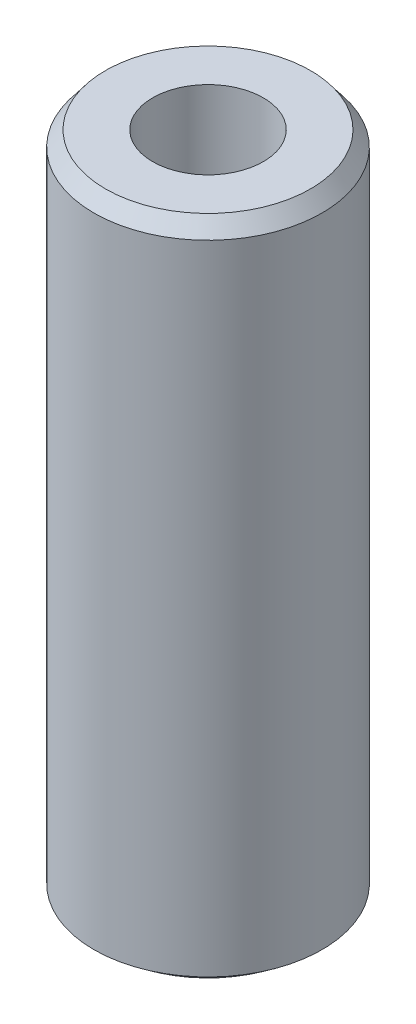
ISO-10303-21;
HEADER;
FILE_DESCRIPTION(('STEP AP214'),'2;1');
FILE_NAME('part.step','',(''),(''),'','','');
FILE_SCHEMA(('AUTOMOTIVE_DESIGN { 1 0 10303 214 1 1 1 1 }'));
ENDSEC;
DATA;
#1=APPLICATION_CONTEXT('core data for automotive mechanical design processes');
#2=APPLICATION_PROTOCOL_DEFINITION('international standard','automotive_design',2000,#1);
#3=PRODUCT_CONTEXT('',#1,'mechanical');
#4=PRODUCT('Part','Part','',(#3));
#5=PRODUCT_RELATED_PRODUCT_CATEGORY('part','',(#4));
#6=PRODUCT_DEFINITION_FORMATION('','',#4);
#7=PRODUCT_DEFINITION_CONTEXT('part definition',#1,'design');
#8=PRODUCT_DEFINITION('design','',#6,#7);
#9=PRODUCT_DEFINITION_SHAPE('','',#8);
#10=(LENGTH_UNIT() NAMED_UNIT(*) SI_UNIT(.MILLI.,.METRE.));
#11=(NAMED_UNIT(*) PLANE_ANGLE_UNIT() SI_UNIT($,.RADIAN.));
#12=(NAMED_UNIT(*) SI_UNIT($,.STERADIAN.) SOLID_ANGLE_UNIT());
#13=UNCERTAINTY_MEASURE_WITH_UNIT(LENGTH_MEASURE(1.E-05),#10,'distance_accuracy_value','');
#14=(GEOMETRIC_REPRESENTATION_CONTEXT(3) GLOBAL_UNCERTAINTY_ASSIGNED_CONTEXT((#13)) GLOBAL_UNIT_ASSIGNED_CONTEXT((#10,
#11,#12)) REPRESENTATION_CONTEXT('',''));
#15=CARTESIAN_POINT('',(0.,0.,0.));
#16=DIRECTION('',(0.,0.,1.));
#17=DIRECTION('',(1.,0.,0.));
#18=AXIS2_PLACEMENT_3D('',#15,#16,#17);
#19=CARTESIAN_POINT('',(0.,58.2442623741684,0.));
#20=DIRECTION('',(0.,-1.,0.));
#21=DIRECTION('',(0.,0.,-1.));
#22=AXIS2_PLACEMENT_3D('',#19,#20,#21);
#23=CYLINDRICAL_SURFACE('',#22,10.);
#24=CARTESIAN_POINT('',(0.,56.9223678370579,0.));
#25=DIRECTION('',(0.,1.,0.));
#26=DIRECTION('',(0.,0.,1.));
#27=AXIS2_PLACEMENT_3D('',#24,#25,#26);
#28=CIRCLE('',#27,10.);
#29=CARTESIAN_POINT('',(0.,56.9223678370579,10.));
#30=VERTEX_POINT('',#29);
#31=EDGE_CURVE('E50',#30,#30,#28,.F.);
#32=ORIENTED_EDGE('',*,*,#31,.T.);
#33=EDGE_LOOP('',(#32));
#34=FACE_BOUND('',#33,.T.);
#35=CARTESIAN_POINT('',(0.,1.01318082991277,0.));
#36=DIRECTION('',(0.,1.,0.));
#37=DIRECTION('',(0.,0.,1.));
#38=AXIS2_PLACEMENT_3D('',#35,#36,#37);
#39=CIRCLE('',#38,10.);
#40=CARTESIAN_POINT('',(0.,1.01318082991277,10.));
#41=VERTEX_POINT('',#40);
#42=EDGE_CURVE('E51',#41,#41,#39,.T.);
#43=ORIENTED_EDGE('',*,*,#42,.T.);
#44=EDGE_LOOP('',(#43));
#45=FACE_BOUND('',#44,.T.);
#46=ADVANCED_FACE('F39',(#34,#45),#23,.T.);
#47=CARTESIAN_POINT('',(0.,58.2442623741684,0.));
#48=DIRECTION('',(0.,1.,0.));
#49=DIRECTION('',(0.,0.,1.));
#50=AXIS2_PLACEMENT_3D('',#47,#48,#49);
#51=PLANE('',#50);
#52=CARTESIAN_POINT('',(0.,58.2442623741684,0.));
#53=DIRECTION('',(0.,1.,0.));
#54=DIRECTION('',(0.,0.,1.));
#55=AXIS2_PLACEMENT_3D('',#52,#53,#54);
#56=CIRCLE('',#55,8.98681917008725);
#57=CARTESIAN_POINT('',(0.,58.2442623741684,8.98681917008725));
#58=VERTEX_POINT('',#57);
#59=EDGE_CURVE('E54',#58,#58,#56,.T.);
#60=ORIENTED_EDGE('',*,*,#59,.T.);
#61=EDGE_LOOP('',(#60));
#62=FACE_BOUND('',#61,.T.);
#63=CARTESIAN_POINT('',(0.,58.2442623741684,0.));
#64=DIRECTION('',(0.,1.,0.));
#65=DIRECTION('',(0.,0.,1.));
#66=AXIS2_PLACEMENT_3D('',#63,#64,#65);
#67=CIRCLE('',#66,4.85031976580231);
#68=CARTESIAN_POINT('',(0.,58.2442623741684,4.85031976580231));
#69=VERTEX_POINT('',#68);
#70=EDGE_CURVE('E58',#69,#69,#67,.T.);
#71=ORIENTED_EDGE('',*,*,#70,.F.);
#72=EDGE_LOOP('',(#71));
#73=FACE_BOUND('',#72,.T.);
#74=ADVANCED_FACE('F69',(#62,#73),#51,.T.);
#75=CARTESIAN_POINT('',(0.,0.,0.));
#76=DIRECTION('',(0.,1.,0.));
#77=DIRECTION('',(0.,0.,1.));
#78=AXIS2_PLACEMENT_3D('',#75,#76,#77);
#79=PLANE('',#78);
#80=CARTESIAN_POINT('',(0.,0.,0.));
#81=DIRECTION('',(0.,1.,0.));
#82=DIRECTION('',(0.,0.,1.));
#83=AXIS2_PLACEMENT_3D('',#80,#81,#82);
#84=CIRCLE('',#83,8.67810546288944);
#85=CARTESIAN_POINT('',(0.,0.,8.67810546288944));
#86=VERTEX_POINT('',#85);
#87=EDGE_CURVE('E10',#86,#86,#84,.F.);
#88=ORIENTED_EDGE('',*,*,#87,.T.);
#89=EDGE_LOOP('',(#88));
#90=FACE_BOUND('',#89,.T.);
#91=CARTESIAN_POINT('',(0.,0.,0.));
#92=DIRECTION('',(0.,1.,0.));
#93=DIRECTION('',(0.,0.,1.));
#94=AXIS2_PLACEMENT_3D('',#91,#92,#93);
#95=CIRCLE('',#94,4.85031976580231);
#96=CARTESIAN_POINT('',(0.,0.,4.85031976580231));
#97=VERTEX_POINT('',#96);
#98=EDGE_CURVE('E63',#97,#97,#95,.T.);
#99=ORIENTED_EDGE('',*,*,#98,.T.);
#100=EDGE_LOOP('',(#99));
#101=FACE_BOUND('',#100,.T.);
#102=ADVANCED_FACE('F75',(#90,#101),#79,.F.);
#103=CARTESIAN_POINT('',(0.,58.2442623741684,0.));
#104=DIRECTION('',(0.,-1.,0.));
#105=DIRECTION('',(0.,0.,-1.));
#106=AXIS2_PLACEMENT_3D('',#103,#104,#105);
#107=CYLINDRICAL_SURFACE('',#106,4.85031976580231);
#108=ORIENTED_EDGE('',*,*,#70,.T.);
#109=EDGE_LOOP('',(#108));
#110=FACE_BOUND('',#109,.T.);
#111=ORIENTED_EDGE('',*,*,#98,.F.);
#112=EDGE_LOOP('',(#111));
#113=FACE_BOUND('',#112,.T.);
#114=ADVANCED_FACE('F70',(#110,#113),#107,.F.);
#115=CARTESIAN_POINT('',(0.,58.2442623741684,0.));
#116=DIRECTION('',(0.,-1.,0.));
#117=DIRECTION('',(0.,0.,-1.));
#118=AXIS2_PLACEMENT_3D('',#115,#116,#117);
#119=CONICAL_SURFACE('',#118,8.98681917008725,0.653953285774982);
#120=ORIENTED_EDGE('',*,*,#31,.F.);
#121=EDGE_LOOP('',(#120));
#122=FACE_BOUND('',#121,.T.);
#123=ORIENTED_EDGE('',*,*,#59,.F.);
#124=EDGE_LOOP('',(#123));
#125=FACE_BOUND('',#124,.T.);
#126=ADVANCED_FACE('F81',(#122,#125),#119,.T.);
#127=CARTESIAN_POINT('',(0.,1.01318082991277,0.));
#128=DIRECTION('',(0.,1.,0.));
#129=DIRECTION('',(0.,0.,1.));
#130=AXIS2_PLACEMENT_3D('',#127,#128,#129);
#131=CONICAL_SURFACE('',#130,10.,0.916843041019919);
#132=ORIENTED_EDGE('',*,*,#87,.F.);
#133=EDGE_LOOP('',(#132));
#134=FACE_BOUND('',#133,.T.);
#135=ORIENTED_EDGE('',*,*,#42,.F.);
#136=EDGE_LOOP('',(#135));
#137=FACE_BOUND('',#136,.T.);
#138=ADVANCED_FACE('F45',(#134,#137),#131,.T.);
#139=CLOSED_SHELL('',(#46,#74,#102,#114,#126,#138));
#140=MANIFOLD_SOLID_BREP('B2',#139);
#141=ADVANCED_BREP_SHAPE_REPRESENTATION('',(#18,#140),#14);
#142=SHAPE_DEFINITION_REPRESENTATION(#9,#141);
ENDSEC;
END-ISO-10303-21;
